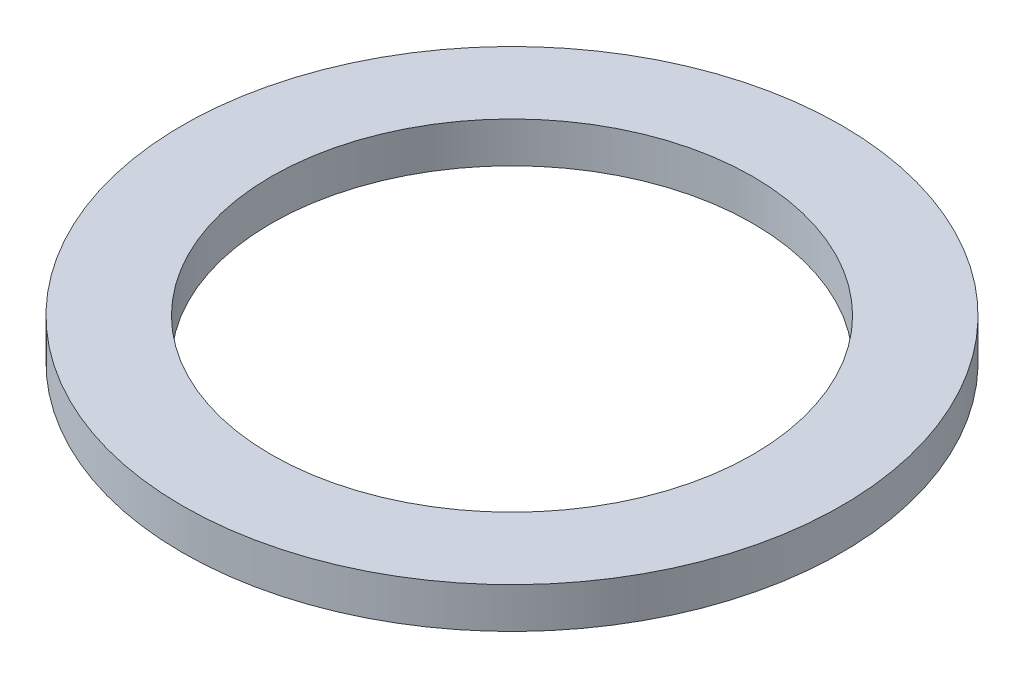
ISO-10303-21;
HEADER;
FILE_DESCRIPTION(('STEP AP214'),'2;1');
FILE_NAME('part.step','',(''),(''),'','','');
FILE_SCHEMA(('AUTOMOTIVE_DESIGN { 1 0 10303 214 1 1 1 1 }'));
ENDSEC;
DATA;
#1=APPLICATION_CONTEXT('core data for automotive mechanical design processes');
#2=APPLICATION_PROTOCOL_DEFINITION('international standard','automotive_design',2000,#1);
#3=PRODUCT_CONTEXT('',#1,'mechanical');
#4=PRODUCT('Part','Part','',(#3));
#5=PRODUCT_RELATED_PRODUCT_CATEGORY('part','',(#4));
#6=PRODUCT_DEFINITION_FORMATION('','',#4);
#7=PRODUCT_DEFINITION_CONTEXT('part definition',#1,'design');
#8=PRODUCT_DEFINITION('design','',#6,#7);
#9=PRODUCT_DEFINITION_SHAPE('','',#8);
#10=(LENGTH_UNIT() NAMED_UNIT(*) SI_UNIT(.MILLI.,.METRE.));
#11=(NAMED_UNIT(*) PLANE_ANGLE_UNIT() SI_UNIT($,.RADIAN.));
#12=(NAMED_UNIT(*) SI_UNIT($,.STERADIAN.) SOLID_ANGLE_UNIT());
#13=UNCERTAINTY_MEASURE_WITH_UNIT(LENGTH_MEASURE(1.E-05),#10,'distance_accuracy_value','');
#14=(GEOMETRIC_REPRESENTATION_CONTEXT(3) GLOBAL_UNCERTAINTY_ASSIGNED_CONTEXT((#13)) GLOBAL_UNIT_ASSIGNED_CONTEXT((#10,
#11,#12)) REPRESENTATION_CONTEXT('',''));
#15=CARTESIAN_POINT('',(0.,0.,0.));
#16=DIRECTION('',(0.,0.,1.));
#17=DIRECTION('',(1.,0.,0.));
#18=AXIS2_PLACEMENT_3D('',#15,#16,#17);
#19=CARTESIAN_POINT('',(0.,8.,0.));
#20=DIRECTION('',(0.,-1.,0.));
#21=DIRECTION('',(0.,0.,-1.));
#22=AXIS2_PLACEMENT_3D('',#19,#20,#21);
#23=CYLINDRICAL_SURFACE('',#22,65.);
#24=CARTESIAN_POINT('',(0.,8.,0.));
#25=DIRECTION('',(0.,1.,0.));
#26=DIRECTION('',(0.,0.,1.));
#27=AXIS2_PLACEMENT_3D('',#24,#25,#26);
#28=CIRCLE('',#27,65.);
#29=CARTESIAN_POINT('',(0.,8.,65.));
#30=VERTEX_POINT('',#29);
#31=EDGE_CURVE('E10',#30,#30,#28,.T.);
#32=ORIENTED_EDGE('',*,*,#31,.F.);
#33=EDGE_LOOP('',(#32));
#34=FACE_BOUND('',#33,.T.);
#35=CARTESIAN_POINT('',(0.,0.,0.));
#36=DIRECTION('',(0.,1.,0.));
#37=DIRECTION('',(0.,0.,1.));
#38=AXIS2_PLACEMENT_3D('',#35,#36,#37);
#39=CIRCLE('',#38,65.);
#40=CARTESIAN_POINT('',(0.,0.,65.));
#41=VERTEX_POINT('',#40);
#42=EDGE_CURVE('E37',#41,#41,#39,.T.);
#43=ORIENTED_EDGE('',*,*,#42,.T.);
#44=EDGE_LOOP('',(#43));
#45=FACE_BOUND('',#44,.T.);
#46=ADVANCED_FACE('F40',(#34,#45),#23,.T.);
#47=CARTESIAN_POINT('',(0.,8.,0.));
#48=DIRECTION('',(0.,1.,0.));
#49=DIRECTION('',(0.,0.,1.));
#50=AXIS2_PLACEMENT_3D('',#47,#48,#49);
#51=PLANE('',#50);
#52=CARTESIAN_POINT('',(0.,8.,0.));
#53=DIRECTION('',(0.,1.,0.));
#54=DIRECTION('',(0.,0.,1.));
#55=AXIS2_PLACEMENT_3D('',#52,#53,#54);
#56=CIRCLE('',#55,47.5);
#57=CARTESIAN_POINT('',(0.,8.,47.5));
#58=VERTEX_POINT('',#57);
#59=EDGE_CURVE('E50',#58,#58,#56,.T.);
#60=ORIENTED_EDGE('',*,*,#59,.F.);
#61=EDGE_LOOP('',(#60));
#62=FACE_BOUND('',#61,.T.);
#63=ORIENTED_EDGE('',*,*,#31,.T.);
#64=EDGE_LOOP('',(#63));
#65=FACE_BOUND('',#64,.T.);
#66=ADVANCED_FACE('F59',(#62,#65),#51,.T.);
#67=CARTESIAN_POINT('',(0.,0.,0.));
#68=DIRECTION('',(0.,1.,0.));
#69=DIRECTION('',(0.,0.,1.));
#70=AXIS2_PLACEMENT_3D('',#67,#68,#69);
#71=PLANE('',#70);
#72=CARTESIAN_POINT('',(0.,0.,0.));
#73=DIRECTION('',(0.,1.,0.));
#74=DIRECTION('',(0.,0.,1.));
#75=AXIS2_PLACEMENT_3D('',#72,#73,#74);
#76=CIRCLE('',#75,47.5);
#77=CARTESIAN_POINT('',(0.,0.,47.5));
#78=VERTEX_POINT('',#77);
#79=EDGE_CURVE('E47',#78,#78,#76,.T.);
#80=ORIENTED_EDGE('',*,*,#79,.T.);
#81=EDGE_LOOP('',(#80));
#82=FACE_BOUND('',#81,.T.);
#83=ORIENTED_EDGE('',*,*,#42,.F.);
#84=EDGE_LOOP('',(#83));
#85=FACE_BOUND('',#84,.T.);
#86=ADVANCED_FACE('F58',(#82,#85),#71,.F.);
#87=CARTESIAN_POINT('',(0.,8.,0.));
#88=DIRECTION('',(0.,-1.,0.));
#89=DIRECTION('',(0.,0.,-1.));
#90=AXIS2_PLACEMENT_3D('',#87,#88,#89);
#91=CYLINDRICAL_SURFACE('',#90,47.5);
#92=ORIENTED_EDGE('',*,*,#59,.T.);
#93=EDGE_LOOP('',(#92));
#94=FACE_BOUND('',#93,.T.);
#95=ORIENTED_EDGE('',*,*,#79,.F.);
#96=EDGE_LOOP('',(#95));
#97=FACE_BOUND('',#96,.T.);
#98=ADVANCED_FACE('F54',(#94,#97),#91,.F.);
#99=CLOSED_SHELL('',(#46,#66,#86,#98));
#100=MANIFOLD_SOLID_BREP('B2',#99);
#101=ADVANCED_BREP_SHAPE_REPRESENTATION('',(#18,#100),#14);
#102=SHAPE_DEFINITION_REPRESENTATION(#9,#101);
ENDSEC;
END-ISO-10303-21;
